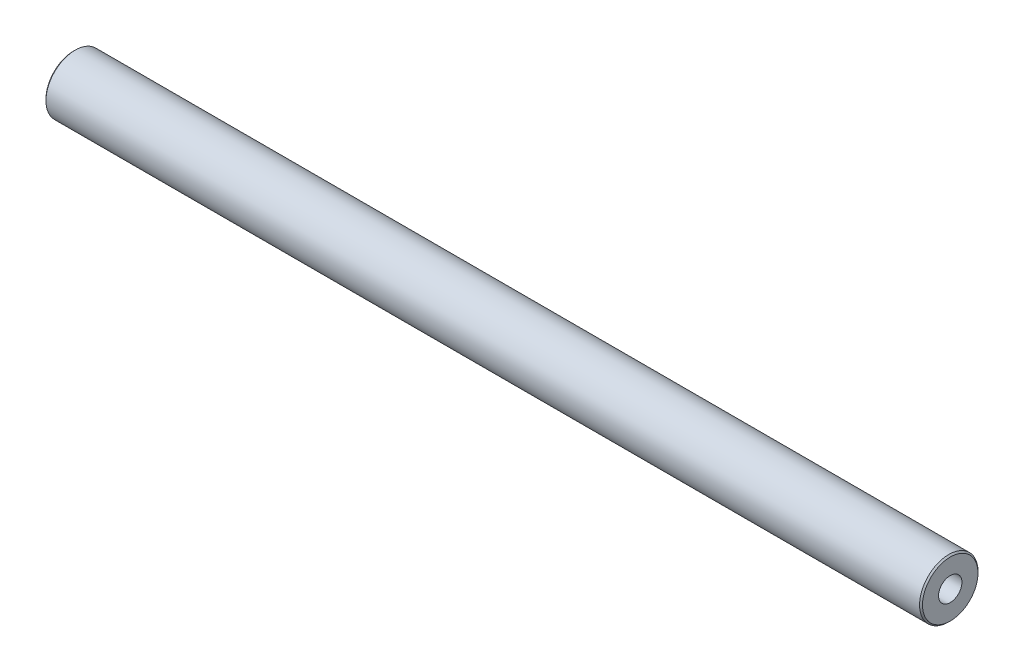
ISO-10303-21;
HEADER;
FILE_DESCRIPTION(('STEP AP214'),'2;1');
FILE_NAME('part.step','',(''),(''),'','','');
FILE_SCHEMA(('AUTOMOTIVE_DESIGN { 1 0 10303 214 1 1 1 1 }'));
ENDSEC;
DATA;
#1=APPLICATION_CONTEXT('core data for automotive mechanical design processes');
#2=APPLICATION_PROTOCOL_DEFINITION('international standard','automotive_design',2000,#1);
#3=PRODUCT_CONTEXT('',#1,'mechanical');
#4=PRODUCT('Part','Part','',(#3));
#5=PRODUCT_RELATED_PRODUCT_CATEGORY('part','',(#4));
#6=PRODUCT_DEFINITION_FORMATION('','',#4);
#7=PRODUCT_DEFINITION_CONTEXT('part definition',#1,'design');
#8=PRODUCT_DEFINITION('design','',#6,#7);
#9=PRODUCT_DEFINITION_SHAPE('','',#8);
#10=(LENGTH_UNIT() NAMED_UNIT(*) SI_UNIT(.MILLI.,.METRE.));
#11=(NAMED_UNIT(*) PLANE_ANGLE_UNIT() SI_UNIT($,.RADIAN.));
#12=(NAMED_UNIT(*) SI_UNIT($,.STERADIAN.) SOLID_ANGLE_UNIT());
#13=UNCERTAINTY_MEASURE_WITH_UNIT(LENGTH_MEASURE(1.E-05),#10,'distance_accuracy_value','');
#14=(GEOMETRIC_REPRESENTATION_CONTEXT(3) GLOBAL_UNCERTAINTY_ASSIGNED_CONTEXT((#13)) GLOBAL_UNIT_ASSIGNED_CONTEXT((#10,
#11,#12)) REPRESENTATION_CONTEXT('',''));
#15=CARTESIAN_POINT('',(0.,0.,0.));
#16=DIRECTION('',(0.,0.,1.));
#17=DIRECTION('',(1.,0.,0.));
#18=AXIS2_PLACEMENT_3D('',#15,#16,#17);
#19=CARTESIAN_POINT('',(-75.,0.,0.));
#20=DIRECTION('',(1.,0.,0.));
#21=DIRECTION('',(0.,0.,-1.));
#22=AXIS2_PLACEMENT_3D('',#19,#20,#21);
#23=CYLINDRICAL_SURFACE('',#22,2.);
#24=CARTESIAN_POINT('',(75.,0.,0.));
#25=DIRECTION('',(1.,0.,0.));
#26=DIRECTION('',(0.,0.,-1.));
#27=AXIS2_PLACEMENT_3D('',#24,#25,#26);
#28=CIRCLE('',#27,2.);
#29=CARTESIAN_POINT('',(75.,0.,-2.));
#30=VERTEX_POINT('',#29);
#31=EDGE_CURVE('E17',#30,#30,#28,.F.);
#32=ORIENTED_EDGE('',*,*,#31,.F.);
#33=EDGE_LOOP('',(#32));
#34=FACE_BOUND('',#33,.T.);
#35=CARTESIAN_POINT('',(-75.,0.,0.));
#36=DIRECTION('',(1.,0.,0.));
#37=DIRECTION('',(0.,0.,-1.));
#38=AXIS2_PLACEMENT_3D('',#35,#36,#37);
#39=CIRCLE('',#38,2.);
#40=CARTESIAN_POINT('',(-75.,0.,-2.));
#41=VERTEX_POINT('',#40);
#42=EDGE_CURVE('E33',#41,#41,#39,.F.);
#43=ORIENTED_EDGE('',*,*,#42,.T.);
#44=EDGE_LOOP('',(#43));
#45=FACE_BOUND('',#44,.T.);
#46=ADVANCED_FACE('F14',(#34,#45),#23,.F.);
#47=CARTESIAN_POINT('',(75.,0.,0.));
#48=DIRECTION('',(1.,0.,0.));
#49=DIRECTION('',(0.,0.,-1.));
#50=AXIS2_PLACEMENT_3D('',#47,#48,#49);
#51=PLANE('',#50);
#52=ORIENTED_EDGE('',*,*,#31,.T.);
#53=EDGE_LOOP('',(#52));
#54=FACE_BOUND('',#53,.T.);
#55=CARTESIAN_POINT('',(75.0000000000455,0.,0.));
#56=DIRECTION('',(-1.,0.,0.));
#57=DIRECTION('',(0.,0.,1.));
#58=AXIS2_PLACEMENT_3D('',#55,#56,#57);
#59=CIRCLE('',#58,4.75000000000136);
#60=CARTESIAN_POINT('',(75.0000000000455,0.,4.75000000000136));
#61=VERTEX_POINT('',#60);
#62=EDGE_CURVE('E31',#61,#61,#59,.T.);
#63=ORIENTED_EDGE('',*,*,#62,.F.);
#64=EDGE_LOOP('',(#63));
#65=FACE_BOUND('',#64,.T.);
#66=ADVANCED_FACE('F40',(#54,#65),#51,.T.);
#67=CARTESIAN_POINT('',(-75.,0.,0.));
#68=DIRECTION('',(1.,0.,0.));
#69=DIRECTION('',(0.,0.,-1.));
#70=AXIS2_PLACEMENT_3D('',#67,#68,#69);
#71=PLANE('',#70);
#72=ORIENTED_EDGE('',*,*,#42,.F.);
#73=EDGE_LOOP('',(#72));
#74=FACE_BOUND('',#73,.T.);
#75=CARTESIAN_POINT('',(-75.0000000000455,0.,0.));
#76=DIRECTION('',(1.,0.,0.));
#77=DIRECTION('',(0.,0.,-1.));
#78=AXIS2_PLACEMENT_3D('',#75,#76,#77);
#79=CIRCLE('',#78,4.75000000000136);
#80=CARTESIAN_POINT('',(-75.0000000000455,0.,-4.75000000000136));
#81=VERTEX_POINT('',#80);
#82=EDGE_CURVE('E26',#81,#81,#79,.T.);
#83=ORIENTED_EDGE('',*,*,#82,.F.);
#84=EDGE_LOOP('',(#83));
#85=FACE_BOUND('',#84,.T.);
#86=ADVANCED_FACE('F48',(#74,#85),#71,.F.);
#87=CARTESIAN_POINT('',(74.7499999999945,0.,0.));
#88=DIRECTION('',(-1.,0.,0.));
#89=DIRECTION('',(0.,0.,1.));
#90=AXIS2_PLACEMENT_3D('',#87,#88,#89);
#91=CONICAL_SURFACE('',#90,4.99999999999545,0.785398163283761);
#92=CARTESIAN_POINT('',(74.75,0.,0.));
#93=DIRECTION('',(1.,0.,0.));
#94=DIRECTION('',(0.,0.,-1.));
#95=AXIS2_PLACEMENT_3D('',#92,#93,#94);
#96=CIRCLE('',#95,5.);
#97=CARTESIAN_POINT('',(74.75,0.,-5.));
#98=VERTEX_POINT('',#97);
#99=EDGE_CURVE('E21',#98,#98,#96,.F.);
#100=ORIENTED_EDGE('',*,*,#99,.F.);
#101=EDGE_LOOP('',(#100));
#102=FACE_BOUND('',#101,.T.);
#103=ORIENTED_EDGE('',*,*,#62,.T.);
#104=EDGE_LOOP('',(#103));
#105=FACE_BOUND('',#104,.T.);
#106=ADVANCED_FACE('F57',(#102,#105),#91,.T.);
#107=CARTESIAN_POINT('',(-74.7499999999945,0.,0.));
#108=DIRECTION('',(1.,0.,0.));
#109=DIRECTION('',(0.,0.,-1.));
#110=AXIS2_PLACEMENT_3D('',#107,#108,#109);
#111=CONICAL_SURFACE('',#110,4.99999999999545,0.785398163283761);
#112=CARTESIAN_POINT('',(-74.75,0.,0.));
#113=DIRECTION('',(1.,0.,0.));
#114=DIRECTION('',(0.,0.,-1.));
#115=AXIS2_PLACEMENT_3D('',#112,#113,#114);
#116=CIRCLE('',#115,5.);
#117=CARTESIAN_POINT('',(-74.75,0.,-5.));
#118=VERTEX_POINT('',#117);
#119=EDGE_CURVE('E10',#118,#118,#116,.T.);
#120=ORIENTED_EDGE('',*,*,#119,.F.);
#121=EDGE_LOOP('',(#120));
#122=FACE_BOUND('',#121,.T.);
#123=ORIENTED_EDGE('',*,*,#82,.T.);
#124=EDGE_LOOP('',(#123));
#125=FACE_BOUND('',#124,.T.);
#126=ADVANCED_FACE('F51',(#122,#125),#111,.T.);
#127=CARTESIAN_POINT('',(-75.,0.,0.));
#128=DIRECTION('',(1.,0.,0.));
#129=DIRECTION('',(0.,0.,-1.));
#130=AXIS2_PLACEMENT_3D('',#127,#128,#129);
#131=CYLINDRICAL_SURFACE('',#130,5.);
#132=ORIENTED_EDGE('',*,*,#99,.T.);
#133=EDGE_LOOP('',(#132));
#134=FACE_BOUND('',#133,.T.);
#135=ORIENTED_EDGE('',*,*,#119,.T.);
#136=EDGE_LOOP('',(#135));
#137=FACE_BOUND('',#136,.T.);
#138=ADVANCED_FACE('F49',(#134,#137),#131,.T.);
#139=CLOSED_SHELL('',(#46,#66,#86,#106,#126,#138));
#140=MANIFOLD_SOLID_BREP('B1',#139);
#141=ADVANCED_BREP_SHAPE_REPRESENTATION('',(#18,#140),#14);
#142=SHAPE_DEFINITION_REPRESENTATION(#9,#141);
ENDSEC;
END-ISO-10303-21;
